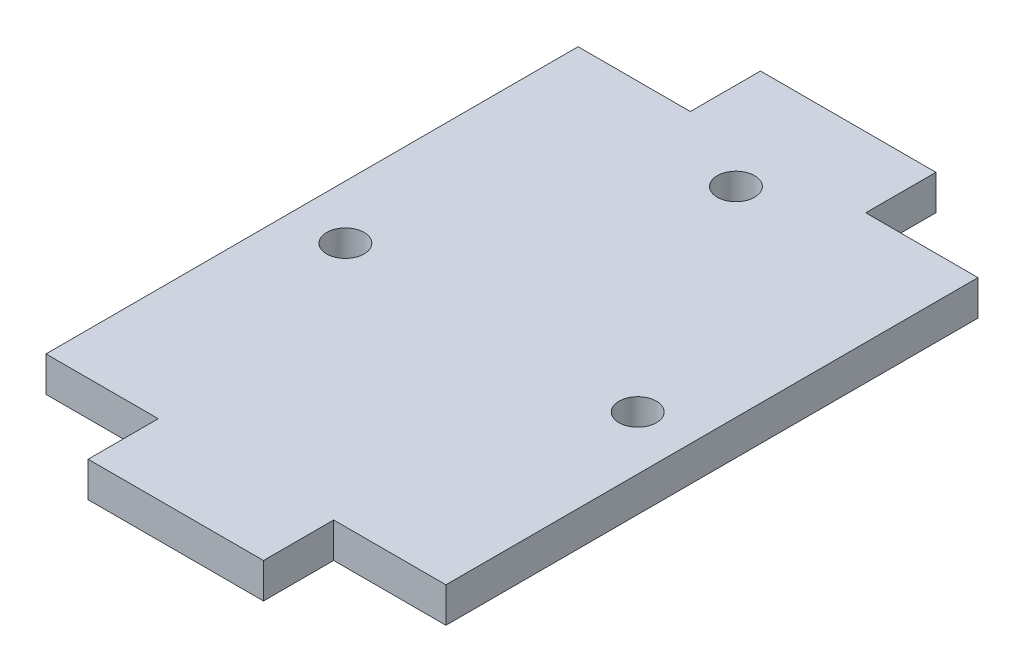
ISO-10303-21;
HEADER;
FILE_DESCRIPTION(('STEP AP214'),'2;1');
FILE_NAME('part.step','',(''),(''),'','','');
FILE_SCHEMA(('AUTOMOTIVE_DESIGN { 1 0 10303 214 1 1 1 1 }'));
ENDSEC;
DATA;
#1=APPLICATION_CONTEXT('core data for automotive mechanical design processes');
#2=APPLICATION_PROTOCOL_DEFINITION('international standard','automotive_design',2000,#1);
#3=PRODUCT_CONTEXT('',#1,'mechanical');
#4=PRODUCT('Part','Part','',(#3));
#5=PRODUCT_RELATED_PRODUCT_CATEGORY('part','',(#4));
#6=PRODUCT_DEFINITION_FORMATION('','',#4);
#7=PRODUCT_DEFINITION_CONTEXT('part definition',#1,'design');
#8=PRODUCT_DEFINITION('design','',#6,#7);
#9=PRODUCT_DEFINITION_SHAPE('','',#8);
#10=(LENGTH_UNIT() NAMED_UNIT(*) SI_UNIT(.MILLI.,.METRE.));
#11=(NAMED_UNIT(*) PLANE_ANGLE_UNIT() SI_UNIT($,.RADIAN.));
#12=(NAMED_UNIT(*) SI_UNIT($,.STERADIAN.) SOLID_ANGLE_UNIT());
#13=UNCERTAINTY_MEASURE_WITH_UNIT(LENGTH_MEASURE(1.E-05),#10,'distance_accuracy_value','');
#14=(GEOMETRIC_REPRESENTATION_CONTEXT(3) GLOBAL_UNCERTAINTY_ASSIGNED_CONTEXT((#13)) GLOBAL_UNIT_ASSIGNED_CONTEXT((#10,
#11,#12)) REPRESENTATION_CONTEXT('',''));
#15=CARTESIAN_POINT('',(0.,0.,0.));
#16=DIRECTION('',(0.,0.,1.));
#17=DIRECTION('',(1.,0.,0.));
#18=AXIS2_PLACEMENT_3D('',#15,#16,#17);
#19=CARTESIAN_POINT('',(17.1,-3.,-3.60000000000002));
#20=DIRECTION('',(1.,0.,0.));
#21=DIRECTION('',(0.,0.,-1.));
#22=AXIS2_PLACEMENT_3D('',#19,#20,#21);
#23=PLANE('',#22);
#24=DIRECTION('',(0.,0.,1.));
#25=VECTOR('',#24,1.);
#26=CARTESIAN_POINT('',(17.1,-6.,-3.60000000000002));
#27=LINE('',#26,#25);
#28=CARTESIAN_POINT('',(17.1,-6.,-3.60000000000002));
#29=VERTEX_POINT('',#28);
#30=CARTESIAN_POINT('',(17.1,-6.,41.9));
#31=VERTEX_POINT('',#30);
#32=EDGE_CURVE('E153',#29,#31,#27,.T.);
#33=ORIENTED_EDGE('',*,*,#32,.F.);
#34=DIRECTION('',(0.,-1.,0.));
#35=VECTOR('',#34,1.);
#36=CARTESIAN_POINT('',(17.1,-3.,-3.60000000000002));
#37=LINE('',#36,#35);
#38=CARTESIAN_POINT('',(17.1,-3.,-3.60000000000002));
#39=VERTEX_POINT('',#38);
#40=EDGE_CURVE('E11',#39,#29,#37,.T.);
#41=ORIENTED_EDGE('',*,*,#40,.F.);
#42=DIRECTION('',(0.,0.,1.));
#43=VECTOR('',#42,1.);
#44=CARTESIAN_POINT('',(17.1,-3.,-3.60000000000002));
#45=LINE('',#44,#43);
#46=CARTESIAN_POINT('',(17.1,-3.,41.9));
#47=VERTEX_POINT('',#46);
#48=EDGE_CURVE('E186',#39,#47,#45,.T.);
#49=ORIENTED_EDGE('',*,*,#48,.T.);
#50=DIRECTION('',(0.,-1.,0.));
#51=VECTOR('',#50,1.);
#52=CARTESIAN_POINT('',(17.1,-3.,41.9));
#53=LINE('',#52,#51);
#54=EDGE_CURVE('E35',#47,#31,#53,.T.);
#55=ORIENTED_EDGE('',*,*,#54,.T.);
#56=EDGE_LOOP('',(#33,#41,#49,#55));
#57=FACE_BOUND('',#56,.T.);
#58=ADVANCED_FACE('F32',(#57),#23,.T.);
#59=CARTESIAN_POINT('',(7.50000000000001,-3.,-3.60000000000002));
#60=DIRECTION('',(0.,0.,-1.));
#61=DIRECTION('',(-1.,0.,0.));
#62=AXIS2_PLACEMENT_3D('',#59,#60,#61);
#63=PLANE('',#62);
#64=DIRECTION('',(1.,0.,0.));
#65=VECTOR('',#64,1.);
#66=CARTESIAN_POINT('',(7.50000000000001,-6.,-3.60000000000002));
#67=LINE('',#66,#65);
#68=CARTESIAN_POINT('',(7.50000000000001,-6.,-3.60000000000002));
#69=VERTEX_POINT('',#68);
#70=EDGE_CURVE('E184',#69,#29,#67,.T.);
#71=ORIENTED_EDGE('',*,*,#70,.F.);
#72=DIRECTION('',(0.,-1.,0.));
#73=VECTOR('',#72,1.);
#74=CARTESIAN_POINT('',(7.50000000000001,-3.,-3.60000000000002));
#75=LINE('',#74,#73);
#76=CARTESIAN_POINT('',(7.50000000000001,-3.,-3.60000000000002));
#77=VERTEX_POINT('',#76);
#78=EDGE_CURVE('E41',#77,#69,#75,.T.);
#79=ORIENTED_EDGE('',*,*,#78,.F.);
#80=DIRECTION('',(1.,0.,0.));
#81=VECTOR('',#80,1.);
#82=CARTESIAN_POINT('',(7.50000000000001,-3.,-3.60000000000002));
#83=LINE('',#82,#81);
#84=EDGE_CURVE('E143',#77,#39,#83,.T.);
#85=ORIENTED_EDGE('',*,*,#84,.T.);
#86=ORIENTED_EDGE('',*,*,#40,.T.);
#87=EDGE_LOOP('',(#71,#79,#85,#86));
#88=FACE_BOUND('',#87,.T.);
#89=ADVANCED_FACE('F206',(#88),#63,.T.);
#90=CARTESIAN_POINT('',(7.50000000000001,-3.,-9.60000000000002));
#91=DIRECTION('',(1.,0.,0.));
#92=DIRECTION('',(0.,0.,-1.));
#93=AXIS2_PLACEMENT_3D('',#90,#91,#92);
#94=PLANE('',#93);
#95=DIRECTION('',(0.,0.,1.));
#96=VECTOR('',#95,1.);
#97=CARTESIAN_POINT('',(7.50000000000001,-6.,-9.60000000000002));
#98=LINE('',#97,#96);
#99=CARTESIAN_POINT('',(7.50000000000001,-6.,-9.60000000000002));
#100=VERTEX_POINT('',#99);
#101=EDGE_CURVE('E130',#100,#69,#98,.T.);
#102=ORIENTED_EDGE('',*,*,#101,.F.);
#103=DIRECTION('',(0.,-1.,0.));
#104=VECTOR('',#103,1.);
#105=CARTESIAN_POINT('',(7.50000000000001,-3.,-9.60000000000002));
#106=LINE('',#105,#104);
#107=CARTESIAN_POINT('',(7.50000000000001,-3.,-9.60000000000002));
#108=VERTEX_POINT('',#107);
#109=EDGE_CURVE('E125',#108,#100,#106,.T.);
#110=ORIENTED_EDGE('',*,*,#109,.F.);
#111=DIRECTION('',(0.,0.,1.));
#112=VECTOR('',#111,1.);
#113=CARTESIAN_POINT('',(7.50000000000001,-3.,-9.60000000000002));
#114=LINE('',#113,#112);
#115=EDGE_CURVE('E128',#108,#77,#114,.T.);
#116=ORIENTED_EDGE('',*,*,#115,.T.);
#117=ORIENTED_EDGE('',*,*,#78,.T.);
#118=EDGE_LOOP('',(#102,#110,#116,#117));
#119=FACE_BOUND('',#118,.T.);
#120=ADVANCED_FACE('F127',(#119),#94,.T.);
#121=CARTESIAN_POINT('',(-7.50000000000001,-3.,-9.60000000000002));
#122=DIRECTION('',(0.,0.,-1.));
#123=DIRECTION('',(-1.,0.,0.));
#124=AXIS2_PLACEMENT_3D('',#121,#122,#123);
#125=PLANE('',#124);
#126=DIRECTION('',(1.,0.,0.));
#127=VECTOR('',#126,1.);
#128=CARTESIAN_POINT('',(-7.50000000000001,-6.,-9.60000000000002));
#129=LINE('',#128,#127);
#130=CARTESIAN_POINT('',(-7.50000000000001,-6.,-9.60000000000002));
#131=VERTEX_POINT('',#130);
#132=EDGE_CURVE('E181',#131,#100,#129,.T.);
#133=ORIENTED_EDGE('',*,*,#132,.F.);
#134=DIRECTION('',(0.,-1.,0.));
#135=VECTOR('',#134,1.);
#136=CARTESIAN_POINT('',(-7.50000000000001,-3.,-9.60000000000002));
#137=LINE('',#136,#135);
#138=CARTESIAN_POINT('',(-7.50000000000001,-3.,-9.60000000000002));
#139=VERTEX_POINT('',#138);
#140=EDGE_CURVE('E135',#139,#131,#137,.T.);
#141=ORIENTED_EDGE('',*,*,#140,.F.);
#142=DIRECTION('',(1.,0.,0.));
#143=VECTOR('',#142,1.);
#144=CARTESIAN_POINT('',(-7.50000000000001,-3.,-9.60000000000002));
#145=LINE('',#144,#143);
#146=EDGE_CURVE('E141',#139,#108,#145,.T.);
#147=ORIENTED_EDGE('',*,*,#146,.T.);
#148=ORIENTED_EDGE('',*,*,#109,.T.);
#149=EDGE_LOOP('',(#133,#141,#147,#148));
#150=FACE_BOUND('',#149,.T.);
#151=ADVANCED_FACE('F145',(#150),#125,.T.);
#152=CARTESIAN_POINT('',(-7.50000000000001,-3.,-3.60000000000002));
#153=DIRECTION('',(-1.,0.,0.));
#154=DIRECTION('',(0.,0.,1.));
#155=AXIS2_PLACEMENT_3D('',#152,#153,#154);
#156=PLANE('',#155);
#157=DIRECTION('',(0.,0.,-1.));
#158=VECTOR('',#157,1.);
#159=CARTESIAN_POINT('',(-7.50000000000001,-6.,-3.60000000000002));
#160=LINE('',#159,#158);
#161=CARTESIAN_POINT('',(-7.50000000000001,-6.,-3.60000000000002));
#162=VERTEX_POINT('',#161);
#163=EDGE_CURVE('E178',#162,#131,#160,.T.);
#164=ORIENTED_EDGE('',*,*,#163,.F.);
#165=DIRECTION('',(0.,-1.,0.));
#166=VECTOR('',#165,1.);
#167=CARTESIAN_POINT('',(-7.50000000000001,-3.,-3.60000000000002));
#168=LINE('',#167,#166);
#169=CARTESIAN_POINT('',(-7.50000000000001,-3.,-3.60000000000002));
#170=VERTEX_POINT('',#169);
#171=EDGE_CURVE('E190',#170,#162,#168,.T.);
#172=ORIENTED_EDGE('',*,*,#171,.F.);
#173=DIRECTION('',(0.,0.,-1.));
#174=VECTOR('',#173,1.);
#175=CARTESIAN_POINT('',(-7.50000000000001,-3.,-3.60000000000002));
#176=LINE('',#175,#174);
#177=EDGE_CURVE('E146',#170,#139,#176,.T.);
#178=ORIENTED_EDGE('',*,*,#177,.T.);
#179=ORIENTED_EDGE('',*,*,#140,.T.);
#180=EDGE_LOOP('',(#164,#172,#178,#179));
#181=FACE_BOUND('',#180,.T.);
#182=ADVANCED_FACE('F219',(#181),#156,.T.);
#183=CARTESIAN_POINT('',(-17.1,-3.,-3.60000000000002));
#184=DIRECTION('',(0.,0.,-1.));
#185=DIRECTION('',(-1.,0.,0.));
#186=AXIS2_PLACEMENT_3D('',#183,#184,#185);
#187=PLANE('',#186);
#188=DIRECTION('',(1.,0.,0.));
#189=VECTOR('',#188,1.);
#190=CARTESIAN_POINT('',(-17.1,-6.,-3.60000000000002));
#191=LINE('',#190,#189);
#192=CARTESIAN_POINT('',(-17.1,-6.,-3.60000000000002));
#193=VERTEX_POINT('',#192);
#194=EDGE_CURVE('E175',#193,#162,#191,.T.);
#195=ORIENTED_EDGE('',*,*,#194,.F.);
#196=DIRECTION('',(0.,-1.,0.));
#197=VECTOR('',#196,1.);
#198=CARTESIAN_POINT('',(-17.1,-3.,-3.60000000000002));
#199=LINE('',#198,#197);
#200=CARTESIAN_POINT('',(-17.1,-3.,-3.60000000000002));
#201=VERTEX_POINT('',#200);
#202=EDGE_CURVE('E192',#201,#193,#199,.T.);
#203=ORIENTED_EDGE('',*,*,#202,.F.);
#204=DIRECTION('',(1.,0.,0.));
#205=VECTOR('',#204,1.);
#206=CARTESIAN_POINT('',(-17.1,-3.,-3.60000000000002));
#207=LINE('',#206,#205);
#208=EDGE_CURVE('E148',#201,#170,#207,.T.);
#209=ORIENTED_EDGE('',*,*,#208,.T.);
#210=ORIENTED_EDGE('',*,*,#171,.T.);
#211=EDGE_LOOP('',(#195,#203,#209,#210));
#212=FACE_BOUND('',#211,.T.);
#213=ADVANCED_FACE('F222',(#212),#187,.T.);
#214=CARTESIAN_POINT('',(-17.1,-3.,41.9));
#215=DIRECTION('',(-1.,0.,0.));
#216=DIRECTION('',(0.,0.,1.));
#217=AXIS2_PLACEMENT_3D('',#214,#215,#216);
#218=PLANE('',#217);
#219=DIRECTION('',(0.,0.,-1.));
#220=VECTOR('',#219,1.);
#221=CARTESIAN_POINT('',(-17.1,-6.,41.9));
#222=LINE('',#221,#220);
#223=CARTESIAN_POINT('',(-17.1,-6.,41.9));
#224=VERTEX_POINT('',#223);
#225=EDGE_CURVE('E172',#224,#193,#222,.T.);
#226=ORIENTED_EDGE('',*,*,#225,.F.);
#227=DIRECTION('',(0.,-1.,0.));
#228=VECTOR('',#227,1.);
#229=CARTESIAN_POINT('',(-17.1,-3.,41.9));
#230=LINE('',#229,#228);
#231=CARTESIAN_POINT('',(-17.1,-3.,41.9));
#232=VERTEX_POINT('',#231);
#233=EDGE_CURVE('E194',#232,#224,#230,.T.);
#234=ORIENTED_EDGE('',*,*,#233,.F.);
#235=DIRECTION('',(0.,0.,-1.));
#236=VECTOR('',#235,1.);
#237=CARTESIAN_POINT('',(-17.1,-3.,41.9));
#238=LINE('',#237,#236);
#239=EDGE_CURVE('E306',#232,#201,#238,.T.);
#240=ORIENTED_EDGE('',*,*,#239,.T.);
#241=ORIENTED_EDGE('',*,*,#202,.T.);
#242=EDGE_LOOP('',(#226,#234,#240,#241));
#243=FACE_BOUND('',#242,.T.);
#244=ADVANCED_FACE('F226',(#243),#218,.T.);
#245=CARTESIAN_POINT('',(-7.5,-3.,41.9));
#246=DIRECTION('',(0.,0.,1.));
#247=DIRECTION('',(1.,0.,0.));
#248=AXIS2_PLACEMENT_3D('',#245,#246,#247);
#249=PLANE('',#248);
#250=DIRECTION('',(-1.,0.,0.));
#251=VECTOR('',#250,1.);
#252=CARTESIAN_POINT('',(-7.5,-6.,41.9));
#253=LINE('',#252,#251);
#254=CARTESIAN_POINT('',(-7.5,-6.,41.9));
#255=VERTEX_POINT('',#254);
#256=EDGE_CURVE('E169',#255,#224,#253,.T.);
#257=ORIENTED_EDGE('',*,*,#256,.F.);
#258=DIRECTION('',(0.,-1.,0.));
#259=VECTOR('',#258,1.);
#260=CARTESIAN_POINT('',(-7.5,-3.,41.9));
#261=LINE('',#260,#259);
#262=CARTESIAN_POINT('',(-7.5,-3.,41.9));
#263=VERTEX_POINT('',#262);
#264=EDGE_CURVE('E196',#263,#255,#261,.T.);
#265=ORIENTED_EDGE('',*,*,#264,.F.);
#266=DIRECTION('',(-1.,0.,0.));
#267=VECTOR('',#266,1.);
#268=CARTESIAN_POINT('',(-7.5,-3.,41.9));
#269=LINE('',#268,#267);
#270=EDGE_CURVE('E303',#263,#232,#269,.T.);
#271=ORIENTED_EDGE('',*,*,#270,.T.);
#272=ORIENTED_EDGE('',*,*,#233,.T.);
#273=EDGE_LOOP('',(#257,#265,#271,#272));
#274=FACE_BOUND('',#273,.T.);
#275=ADVANCED_FACE('F230',(#274),#249,.T.);
#276=CARTESIAN_POINT('',(-7.5,-3.,47.9));
#277=DIRECTION('',(-1.,0.,0.));
#278=DIRECTION('',(0.,0.,1.));
#279=AXIS2_PLACEMENT_3D('',#276,#277,#278);
#280=PLANE('',#279);
#281=DIRECTION('',(0.,0.,-1.));
#282=VECTOR('',#281,1.);
#283=CARTESIAN_POINT('',(-7.5,-6.,47.9));
#284=LINE('',#283,#282);
#285=CARTESIAN_POINT('',(-7.5,-6.,47.9));
#286=VERTEX_POINT('',#285);
#287=EDGE_CURVE('E166',#286,#255,#284,.T.);
#288=ORIENTED_EDGE('',*,*,#287,.F.);
#289=DIRECTION('',(0.,-1.,0.));
#290=VECTOR('',#289,1.);
#291=CARTESIAN_POINT('',(-7.5,-3.,47.9));
#292=LINE('',#291,#290);
#293=CARTESIAN_POINT('',(-7.5,-3.,47.9));
#294=VERTEX_POINT('',#293);
#295=EDGE_CURVE('E198',#294,#286,#292,.T.);
#296=ORIENTED_EDGE('',*,*,#295,.F.);
#297=DIRECTION('',(0.,0.,-1.));
#298=VECTOR('',#297,1.);
#299=CARTESIAN_POINT('',(-7.5,-3.,47.9));
#300=LINE('',#299,#298);
#301=EDGE_CURVE('E300',#294,#263,#300,.T.);
#302=ORIENTED_EDGE('',*,*,#301,.T.);
#303=ORIENTED_EDGE('',*,*,#264,.T.);
#304=EDGE_LOOP('',(#288,#296,#302,#303));
#305=FACE_BOUND('',#304,.T.);
#306=ADVANCED_FACE('F234',(#305),#280,.T.);
#307=CARTESIAN_POINT('',(7.5,-3.,47.9));
#308=DIRECTION('',(0.,0.,1.));
#309=DIRECTION('',(1.,0.,0.));
#310=AXIS2_PLACEMENT_3D('',#307,#308,#309);
#311=PLANE('',#310);
#312=DIRECTION('',(-1.,0.,0.));
#313=VECTOR('',#312,1.);
#314=CARTESIAN_POINT('',(7.5,-6.,47.9));
#315=LINE('',#314,#313);
#316=CARTESIAN_POINT('',(7.5,-6.,47.9));
#317=VERTEX_POINT('',#316);
#318=EDGE_CURVE('E163',#317,#286,#315,.T.);
#319=ORIENTED_EDGE('',*,*,#318,.F.);
#320=DIRECTION('',(0.,-1.,0.));
#321=VECTOR('',#320,1.);
#322=CARTESIAN_POINT('',(7.5,-3.,47.9));
#323=LINE('',#322,#321);
#324=CARTESIAN_POINT('',(7.5,-3.,47.9));
#325=VERTEX_POINT('',#324);
#326=EDGE_CURVE('E200',#325,#317,#323,.T.);
#327=ORIENTED_EDGE('',*,*,#326,.F.);
#328=DIRECTION('',(-1.,0.,0.));
#329=VECTOR('',#328,1.);
#330=CARTESIAN_POINT('',(7.5,-3.,47.9));
#331=LINE('',#330,#329);
#332=EDGE_CURVE('E297',#325,#294,#331,.T.);
#333=ORIENTED_EDGE('',*,*,#332,.T.);
#334=ORIENTED_EDGE('',*,*,#295,.T.);
#335=EDGE_LOOP('',(#319,#327,#333,#334));
#336=FACE_BOUND('',#335,.T.);
#337=ADVANCED_FACE('F238',(#336),#311,.T.);
#338=CARTESIAN_POINT('',(7.5,-3.,41.9));
#339=DIRECTION('',(1.,0.,0.));
#340=DIRECTION('',(0.,0.,-1.));
#341=AXIS2_PLACEMENT_3D('',#338,#339,#340);
#342=PLANE('',#341);
#343=DIRECTION('',(0.,0.,1.));
#344=VECTOR('',#343,1.);
#345=CARTESIAN_POINT('',(7.5,-6.,41.9));
#346=LINE('',#345,#344);
#347=CARTESIAN_POINT('',(7.5,-6.,41.9));
#348=VERTEX_POINT('',#347);
#349=EDGE_CURVE('E160',#348,#317,#346,.T.);
#350=ORIENTED_EDGE('',*,*,#349,.F.);
#351=DIRECTION('',(0.,-1.,0.));
#352=VECTOR('',#351,1.);
#353=CARTESIAN_POINT('',(7.5,-3.,41.9));
#354=LINE('',#353,#352);
#355=CARTESIAN_POINT('',(7.5,-3.,41.9));
#356=VERTEX_POINT('',#355);
#357=EDGE_CURVE('E201',#356,#348,#354,.T.);
#358=ORIENTED_EDGE('',*,*,#357,.F.);
#359=DIRECTION('',(0.,0.,1.));
#360=VECTOR('',#359,1.);
#361=CARTESIAN_POINT('',(7.5,-3.,41.9));
#362=LINE('',#361,#360);
#363=EDGE_CURVE('E294',#356,#325,#362,.T.);
#364=ORIENTED_EDGE('',*,*,#363,.T.);
#365=ORIENTED_EDGE('',*,*,#326,.T.);
#366=EDGE_LOOP('',(#350,#358,#364,#365));
#367=FACE_BOUND('',#366,.T.);
#368=ADVANCED_FACE('F242',(#367),#342,.T.);
#369=CARTESIAN_POINT('',(17.1,-3.,41.9));
#370=DIRECTION('',(0.,0.,1.));
#371=DIRECTION('',(1.,0.,0.));
#372=AXIS2_PLACEMENT_3D('',#369,#370,#371);
#373=PLANE('',#372);
#374=DIRECTION('',(-1.,0.,0.));
#375=VECTOR('',#374,1.);
#376=CARTESIAN_POINT('',(17.1,-6.,41.9));
#377=LINE('',#376,#375);
#378=EDGE_CURVE('E156',#31,#348,#377,.T.);
#379=ORIENTED_EDGE('',*,*,#378,.F.);
#380=ORIENTED_EDGE('',*,*,#54,.F.);
#381=DIRECTION('',(-1.,0.,0.));
#382=VECTOR('',#381,1.);
#383=CARTESIAN_POINT('',(17.1,-3.,41.9));
#384=LINE('',#383,#382);
#385=EDGE_CURVE('E292',#47,#356,#384,.T.);
#386=ORIENTED_EDGE('',*,*,#385,.T.);
#387=ORIENTED_EDGE('',*,*,#357,.T.);
#388=EDGE_LOOP('',(#379,#380,#386,#387));
#389=FACE_BOUND('',#388,.T.);
#390=ADVANCED_FACE('F203',(#389),#373,.T.);
#391=CARTESIAN_POINT('',(0.,-3.,0.));
#392=DIRECTION('',(0.,-1.,0.));
#393=DIRECTION('',(0.,0.,-1.));
#394=AXIS2_PLACEMENT_3D('',#391,#392,#393);
#395=PLANE('',#394);
#396=CARTESIAN_POINT('',(12.5,-3.,20.9));
#397=DIRECTION('',(0.,-1.,0.));
#398=DIRECTION('',(0.,0.,1.));
#399=AXIS2_PLACEMENT_3D('',#396,#397,#398);
#400=CIRCLE('',#399,1.59999999999999);
#401=CARTESIAN_POINT('',(12.5,-3.,22.5));
#402=VERTEX_POINT('',#401);
#403=EDGE_CURVE('E273',#402,#402,#400,.T.);
#404=ORIENTED_EDGE('',*,*,#403,.T.);
#405=EDGE_LOOP('',(#404));
#406=FACE_BOUND('',#405,.T.);
#407=CARTESIAN_POINT('',(0.,-3.,0.));
#408=DIRECTION('',(0.,-1.,0.));
#409=DIRECTION('',(0.,0.,1.));
#410=AXIS2_PLACEMENT_3D('',#407,#408,#409);
#411=CIRCLE('',#410,1.59999999999999);
#412=CARTESIAN_POINT('',(0.,-3.,1.59999999999999));
#413=VERTEX_POINT('',#412);
#414=EDGE_CURVE('E281',#413,#413,#411,.T.);
#415=ORIENTED_EDGE('',*,*,#414,.T.);
#416=EDGE_LOOP('',(#415));
#417=FACE_BOUND('',#416,.T.);
#418=CARTESIAN_POINT('',(-12.5,-3.,20.9));
#419=DIRECTION('',(0.,-1.,0.));
#420=DIRECTION('',(0.,0.,1.));
#421=AXIS2_PLACEMENT_3D('',#418,#419,#420);
#422=CIRCLE('',#421,1.59999999999999);
#423=CARTESIAN_POINT('',(-12.5,-3.,22.5));
#424=VERTEX_POINT('',#423);
#425=EDGE_CURVE('E157',#424,#424,#422,.T.);
#426=ORIENTED_EDGE('',*,*,#425,.T.);
#427=EDGE_LOOP('',(#426));
#428=FACE_BOUND('',#427,.T.);
#429=ORIENTED_EDGE('',*,*,#48,.F.);
#430=ORIENTED_EDGE('',*,*,#84,.F.);
#431=ORIENTED_EDGE('',*,*,#115,.F.);
#432=ORIENTED_EDGE('',*,*,#146,.F.);
#433=ORIENTED_EDGE('',*,*,#177,.F.);
#434=ORIENTED_EDGE('',*,*,#208,.F.);
#435=ORIENTED_EDGE('',*,*,#239,.F.);
#436=ORIENTED_EDGE('',*,*,#270,.F.);
#437=ORIENTED_EDGE('',*,*,#301,.F.);
#438=ORIENTED_EDGE('',*,*,#332,.F.);
#439=ORIENTED_EDGE('',*,*,#363,.F.);
#440=ORIENTED_EDGE('',*,*,#385,.F.);
#441=EDGE_LOOP('',(#429,#430,#431,#432,#433,#434,#435,#436,#437,#438,#439,#440));
#442=FACE_BOUND('',#441,.T.);
#443=ADVANCED_FACE('F139',(#406,#417,#428,#442),#395,.F.);
#444=CARTESIAN_POINT('',(0.,-6.,0.));
#445=DIRECTION('',(0.,-1.,0.));
#446=DIRECTION('',(0.,0.,-1.));
#447=AXIS2_PLACEMENT_3D('',#444,#445,#446);
#448=PLANE('',#447);
#449=CARTESIAN_POINT('',(12.5,-6.,20.9));
#450=DIRECTION('',(0.,-1.,0.));
#451=DIRECTION('',(0.,0.,1.));
#452=AXIS2_PLACEMENT_3D('',#449,#450,#451);
#453=CIRCLE('',#452,1.59999999999999);
#454=CARTESIAN_POINT('',(12.5,-6.,22.5));
#455=VERTEX_POINT('',#454);
#456=EDGE_CURVE('E276',#455,#455,#453,.T.);
#457=ORIENTED_EDGE('',*,*,#456,.F.);
#458=EDGE_LOOP('',(#457));
#459=FACE_BOUND('',#458,.T.);
#460=CARTESIAN_POINT('',(0.,-6.,0.));
#461=DIRECTION('',(0.,-1.,0.));
#462=DIRECTION('',(0.,0.,1.));
#463=AXIS2_PLACEMENT_3D('',#460,#461,#462);
#464=CIRCLE('',#463,1.59999999999999);
#465=CARTESIAN_POINT('',(0.,-6.,1.59999999999999));
#466=VERTEX_POINT('',#465);
#467=EDGE_CURVE('E278',#466,#466,#464,.T.);
#468=ORIENTED_EDGE('',*,*,#467,.F.);
#469=EDGE_LOOP('',(#468));
#470=FACE_BOUND('',#469,.T.);
#471=CARTESIAN_POINT('',(-12.5,-6.,20.9));
#472=DIRECTION('',(0.,-1.,0.));
#473=DIRECTION('',(0.,0.,1.));
#474=AXIS2_PLACEMENT_3D('',#471,#472,#473);
#475=CIRCLE('',#474,1.59999999999999);
#476=CARTESIAN_POINT('',(-12.5,-6.,22.5));
#477=VERTEX_POINT('',#476);
#478=EDGE_CURVE('E284',#477,#477,#475,.T.);
#479=ORIENTED_EDGE('',*,*,#478,.F.);
#480=EDGE_LOOP('',(#479));
#481=FACE_BOUND('',#480,.T.);
#482=ORIENTED_EDGE('',*,*,#32,.T.);
#483=ORIENTED_EDGE('',*,*,#378,.T.);
#484=ORIENTED_EDGE('',*,*,#349,.T.);
#485=ORIENTED_EDGE('',*,*,#318,.T.);
#486=ORIENTED_EDGE('',*,*,#287,.T.);
#487=ORIENTED_EDGE('',*,*,#256,.T.);
#488=ORIENTED_EDGE('',*,*,#225,.T.);
#489=ORIENTED_EDGE('',*,*,#194,.T.);
#490=ORIENTED_EDGE('',*,*,#163,.T.);
#491=ORIENTED_EDGE('',*,*,#132,.T.);
#492=ORIENTED_EDGE('',*,*,#101,.T.);
#493=ORIENTED_EDGE('',*,*,#70,.T.);
#494=EDGE_LOOP('',(#482,#483,#484,#485,#486,#487,#488,#489,#490,#491,#492,#493));
#495=FACE_BOUND('',#494,.T.);
#496=ADVANCED_FACE('F205',(#459,#470,#481,#495),#448,.T.);
#497=CARTESIAN_POINT('',(-12.5,-3.,20.9));
#498=DIRECTION('',(0.,-1.,0.));
#499=DIRECTION('',(0.,0.,-1.));
#500=AXIS2_PLACEMENT_3D('',#497,#498,#499);
#501=CYLINDRICAL_SURFACE('',#500,1.59999999999999);
#502=ORIENTED_EDGE('',*,*,#425,.F.);
#503=EDGE_LOOP('',(#502));
#504=FACE_BOUND('',#503,.T.);
#505=ORIENTED_EDGE('',*,*,#478,.T.);
#506=EDGE_LOOP('',(#505));
#507=FACE_BOUND('',#506,.T.);
#508=ADVANCED_FACE('F254',(#504,#507),#501,.F.);
#509=CARTESIAN_POINT('',(0.,-3.,0.));
#510=DIRECTION('',(0.,-1.,0.));
#511=DIRECTION('',(0.,0.,-1.));
#512=AXIS2_PLACEMENT_3D('',#509,#510,#511);
#513=CYLINDRICAL_SURFACE('',#512,1.59999999999999);
#514=ORIENTED_EDGE('',*,*,#414,.F.);
#515=EDGE_LOOP('',(#514));
#516=FACE_BOUND('',#515,.T.);
#517=ORIENTED_EDGE('',*,*,#467,.T.);
#518=EDGE_LOOP('',(#517));
#519=FACE_BOUND('',#518,.T.);
#520=ADVANCED_FACE('F261',(#516,#519),#513,.F.);
#521=CARTESIAN_POINT('',(12.5,-3.,20.9));
#522=DIRECTION('',(0.,-1.,0.));
#523=DIRECTION('',(0.,0.,-1.));
#524=AXIS2_PLACEMENT_3D('',#521,#522,#523);
#525=CYLINDRICAL_SURFACE('',#524,1.59999999999999);
#526=ORIENTED_EDGE('',*,*,#403,.F.);
#527=EDGE_LOOP('',(#526));
#528=FACE_BOUND('',#527,.T.);
#529=ORIENTED_EDGE('',*,*,#456,.T.);
#530=EDGE_LOOP('',(#529));
#531=FACE_BOUND('',#530,.T.);
#532=ADVANCED_FACE('F265',(#528,#531),#525,.F.);
#533=CLOSED_SHELL('',(#58,#89,#120,#151,#182,#213,#244,#275,#306,#337,#368,#390,#443,#496,#508,
#520,#532));
#534=MANIFOLD_SOLID_BREP('B2',#533);
#535=ADVANCED_BREP_SHAPE_REPRESENTATION('',(#18,#534),#14);
#536=SHAPE_DEFINITION_REPRESENTATION(#9,#535);
ENDSEC;
END-ISO-10303-21;
